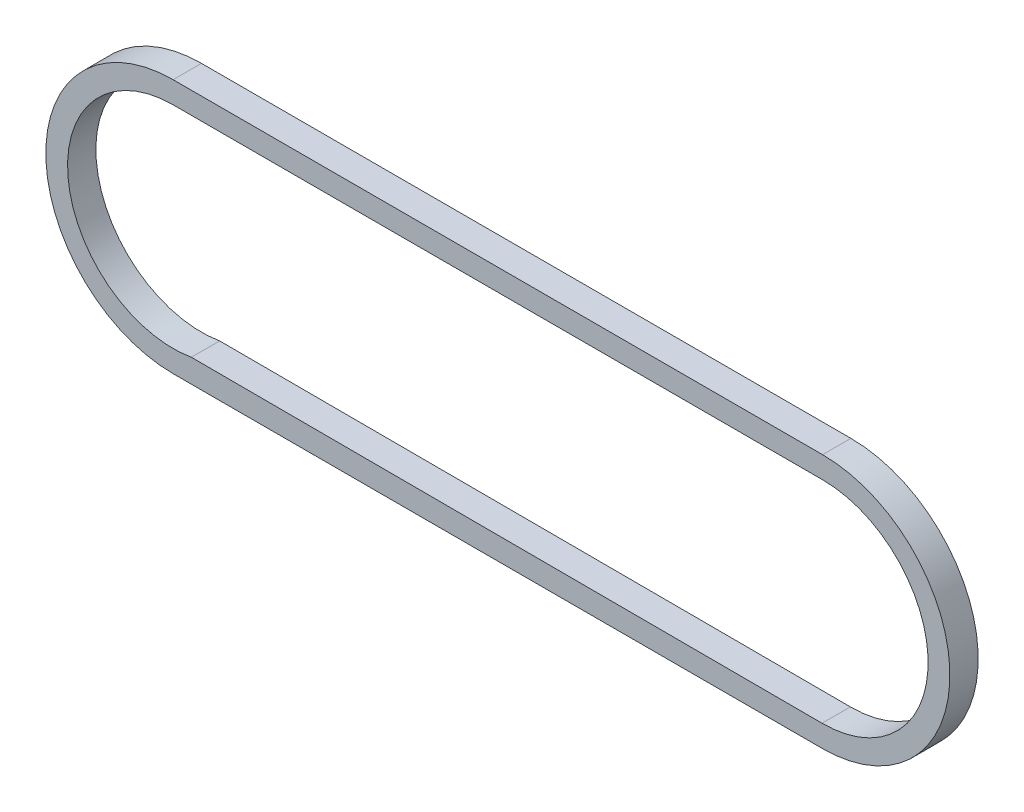
ISO-10303-21;
HEADER;
FILE_DESCRIPTION(('STEP AP214'),'2;1');
FILE_NAME('part.step','',(''),(''),'','','');
FILE_SCHEMA(('AUTOMOTIVE_DESIGN { 1 0 10303 214 1 1 1 1 }'));
ENDSEC;
DATA;
#1=APPLICATION_CONTEXT('core data for automotive mechanical design processes');
#2=APPLICATION_PROTOCOL_DEFINITION('international standard','automotive_design',2000,#1);
#3=PRODUCT_CONTEXT('',#1,'mechanical');
#4=PRODUCT('Part','Part','',(#3));
#5=PRODUCT_RELATED_PRODUCT_CATEGORY('part','',(#4));
#6=PRODUCT_DEFINITION_FORMATION('','',#4);
#7=PRODUCT_DEFINITION_CONTEXT('part definition',#1,'design');
#8=PRODUCT_DEFINITION('design','',#6,#7);
#9=PRODUCT_DEFINITION_SHAPE('','',#8);
#10=(LENGTH_UNIT() NAMED_UNIT(*) SI_UNIT(.MILLI.,.METRE.));
#11=(NAMED_UNIT(*) PLANE_ANGLE_UNIT() SI_UNIT($,.RADIAN.));
#12=(NAMED_UNIT(*) SI_UNIT($,.STERADIAN.) SOLID_ANGLE_UNIT());
#13=UNCERTAINTY_MEASURE_WITH_UNIT(LENGTH_MEASURE(1.E-05),#10,'distance_accuracy_value','');
#14=(GEOMETRIC_REPRESENTATION_CONTEXT(3) GLOBAL_UNCERTAINTY_ASSIGNED_CONTEXT((#13)) GLOBAL_UNIT_ASSIGNED_CONTEXT((#10,
#11,#12)) REPRESENTATION_CONTEXT('',''));
#15=CARTESIAN_POINT('',(0.,0.,0.));
#16=DIRECTION('',(0.,0.,1.));
#17=DIRECTION('',(1.,0.,0.));
#18=AXIS2_PLACEMENT_3D('',#15,#16,#17);
#19=CARTESIAN_POINT('',(0.,49.,-9.9));
#20=DIRECTION('',(0.,-1.,0.));
#21=DIRECTION('',(1.,0.,0.));
#22=AXIS2_PLACEMENT_3D('',#19,#20,#21);
#23=PLANE('',#22);
#24=DIRECTION('',(0.,0.,1.));
#25=VECTOR('',#24,1.);
#26=CARTESIAN_POINT('',(-250.,49.,-9.9));
#27=LINE('',#26,#25);
#28=CARTESIAN_POINT('',(-250.,49.,-9.9));
#29=VERTEX_POINT('',#28);
#30=CARTESIAN_POINT('',(-250.,49.,1.));
#31=VERTEX_POINT('',#30);
#32=EDGE_CURVE('E160',#29,#31,#27,.T.);
#33=ORIENTED_EDGE('',*,*,#32,.T.);
#34=DIRECTION('',(1.,0.,0.));
#35=VECTOR('',#34,1.);
#36=CARTESIAN_POINT('',(0.,49.,1.));
#37=LINE('',#36,#35);
#38=CARTESIAN_POINT('',(0.,49.,1.));
#39=VERTEX_POINT('',#38);
#40=EDGE_CURVE('E130',#31,#39,#37,.T.);
#41=ORIENTED_EDGE('',*,*,#40,.T.);
#42=DIRECTION('',(0.,0.,1.));
#43=VECTOR('',#42,1.);
#44=CARTESIAN_POINT('',(0.,49.,-9.9));
#45=LINE('',#44,#43);
#46=CARTESIAN_POINT('',(0.,49.,-9.9));
#47=VERTEX_POINT('',#46);
#48=EDGE_CURVE('E11',#47,#39,#45,.T.);
#49=ORIENTED_EDGE('',*,*,#48,.F.);
#50=DIRECTION('',(1.,0.,0.));
#51=VECTOR('',#50,1.);
#52=CARTESIAN_POINT('',(0.,49.,-9.9));
#53=LINE('',#52,#51);
#54=EDGE_CURVE('E51',#29,#47,#53,.T.);
#55=ORIENTED_EDGE('',*,*,#54,.F.);
#56=EDGE_LOOP('',(#33,#41,#49,#55));
#57=FACE_BOUND('',#56,.T.);
#58=ADVANCED_FACE('F34',(#57),#23,.F.);
#59=CARTESIAN_POINT('',(0.,0.,-9.9));
#60=DIRECTION('',(0.,0.,1.));
#61=DIRECTION('',(1.,0.,0.));
#62=AXIS2_PLACEMENT_3D('',#59,#60,#61);
#63=CYLINDRICAL_SURFACE('',#62,49.);
#64=ORIENTED_EDGE('',*,*,#48,.T.);
#65=CARTESIAN_POINT('',(0.,0.,1.));
#66=DIRECTION('',(0.,0.,1.));
#67=DIRECTION('',(1.,0.,0.));
#68=AXIS2_PLACEMENT_3D('',#65,#66,#67);
#69=CIRCLE('',#68,49.);
#70=CARTESIAN_POINT('',(0.,-49.,1.));
#71=VERTEX_POINT('',#70);
#72=EDGE_CURVE('E139',#71,#39,#69,.T.);
#73=ORIENTED_EDGE('',*,*,#72,.F.);
#74=DIRECTION('',(0.,0.,1.));
#75=VECTOR('',#74,1.);
#76=CARTESIAN_POINT('',(0.,-49.,-9.9));
#77=LINE('',#76,#75);
#78=CARTESIAN_POINT('',(0.,-49.,-9.9));
#79=VERTEX_POINT('',#78);
#80=EDGE_CURVE('E43',#79,#71,#77,.T.);
#81=ORIENTED_EDGE('',*,*,#80,.F.);
#82=CARTESIAN_POINT('',(0.,0.,-9.9));
#83=DIRECTION('',(0.,0.,1.));
#84=DIRECTION('',(1.,0.,0.));
#85=AXIS2_PLACEMENT_3D('',#82,#83,#84);
#86=CIRCLE('',#85,49.);
#87=EDGE_CURVE('E111',#79,#47,#86,.T.);
#88=ORIENTED_EDGE('',*,*,#87,.T.);
#89=EDGE_LOOP('',(#64,#73,#81,#88));
#90=FACE_BOUND('',#89,.T.);
#91=ADVANCED_FACE('F185',(#90),#63,.T.);
#92=CARTESIAN_POINT('',(0.,-49.,-9.9));
#93=DIRECTION('',(0.,1.,0.));
#94=DIRECTION('',(-1.,0.,0.));
#95=AXIS2_PLACEMENT_3D('',#92,#93,#94);
#96=PLANE('',#95);
#97=ORIENTED_EDGE('',*,*,#80,.T.);
#98=DIRECTION('',(-1.,0.,0.));
#99=VECTOR('',#98,1.);
#100=CARTESIAN_POINT('',(0.,-49.,1.));
#101=LINE('',#100,#99);
#102=CARTESIAN_POINT('',(-250.,-49.0000000000001,1.));
#103=VERTEX_POINT('',#102);
#104=EDGE_CURVE('E136',#71,#103,#101,.T.);
#105=ORIENTED_EDGE('',*,*,#104,.T.);
#106=DIRECTION('',(0.,0.,1.));
#107=VECTOR('',#106,1.);
#108=CARTESIAN_POINT('',(-250.,-49.0000000000001,-9.9));
#109=LINE('',#108,#107);
#110=CARTESIAN_POINT('',(-250.,-49.0000000000001,-9.9));
#111=VERTEX_POINT('',#110);
#112=EDGE_CURVE('E158',#111,#103,#109,.T.);
#113=ORIENTED_EDGE('',*,*,#112,.F.);
#114=DIRECTION('',(-1.,0.,0.));
#115=VECTOR('',#114,1.);
#116=CARTESIAN_POINT('',(0.,-49.,-9.9));
#117=LINE('',#116,#115);
#118=EDGE_CURVE('E154',#79,#111,#117,.T.);
#119=ORIENTED_EDGE('',*,*,#118,.F.);
#120=EDGE_LOOP('',(#97,#105,#113,#119));
#121=FACE_BOUND('',#120,.T.);
#122=ADVANCED_FACE('F191',(#121),#96,.F.);
#123=CARTESIAN_POINT('',(-250.,0.,-9.9));
#124=DIRECTION('',(0.,0.,1.));
#125=DIRECTION('',(1.,0.,0.));
#126=AXIS2_PLACEMENT_3D('',#123,#124,#125);
#127=CYLINDRICAL_SURFACE('',#126,40.63);
#128=DIRECTION('',(0.,0.,1.));
#129=VECTOR('',#128,1.);
#130=CARTESIAN_POINT('',(-250.,40.6299999999999,-9.9));
#131=LINE('',#130,#129);
#132=CARTESIAN_POINT('',(-250.,40.6299999999999,-9.9));
#133=VERTEX_POINT('',#132);
#134=CARTESIAN_POINT('',(-250.,40.6299999999999,1.));
#135=VERTEX_POINT('',#134);
#136=EDGE_CURVE('E38',#133,#135,#131,.T.);
#137=ORIENTED_EDGE('',*,*,#136,.T.);
#138=CARTESIAN_POINT('',(-250.,0.,1.));
#139=DIRECTION('',(0.,0.,1.));
#140=DIRECTION('',(1.,0.,0.));
#141=AXIS2_PLACEMENT_3D('',#138,#139,#140);
#142=CIRCLE('',#141,40.63);
#143=CARTESIAN_POINT('',(-242.97291482572,-40.0177082546392,1.));
#144=VERTEX_POINT('',#143);
#145=EDGE_CURVE('E105',#135,#144,#142,.T.);
#146=ORIENTED_EDGE('',*,*,#145,.T.);
#147=DIRECTION('',(0.,0.,1.));
#148=VECTOR('',#147,1.);
#149=CARTESIAN_POINT('',(-242.97291482572,-40.0177082546392,-9.9));
#150=LINE('',#149,#148);
#151=CARTESIAN_POINT('',(-242.97291482572,-40.0177082546392,-9.9));
#152=VERTEX_POINT('',#151);
#153=EDGE_CURVE('E162',#152,#144,#150,.T.);
#154=ORIENTED_EDGE('',*,*,#153,.F.);
#155=CARTESIAN_POINT('',(-250.,0.,-9.9));
#156=DIRECTION('',(0.,0.,1.));
#157=DIRECTION('',(1.,0.,0.));
#158=AXIS2_PLACEMENT_3D('',#155,#156,#157);
#159=CIRCLE('',#158,40.63);
#160=EDGE_CURVE('E106',#133,#152,#159,.T.);
#161=ORIENTED_EDGE('',*,*,#160,.F.);
#162=EDGE_LOOP('',(#137,#146,#154,#161));
#163=FACE_BOUND('',#162,.T.);
#164=ADVANCED_FACE('F36',(#163),#127,.F.);
#165=CARTESIAN_POINT('',(-0.102386949801904,-40.6297419848865,-9.9));
#166=DIRECTION('',(0.00251999199853385,0.999996824815123,0.));
#167=DIRECTION('',(-0.999996824815123,0.00251999199853385,0.));
#168=AXIS2_PLACEMENT_3D('',#165,#166,#167);
#169=PLANE('',#168);
#170=ORIENTED_EDGE('',*,*,#153,.T.);
#171=DIRECTION('',(-0.999996824815123,0.00251999199853385,0.));
#172=VECTOR('',#171,1.);
#173=CARTESIAN_POINT('',(-0.102386949801904,-40.6297419848865,1.));
#174=LINE('',#173,#172);
#175=CARTESIAN_POINT('',(-0.204773899601046,-40.629483969773,1.));
#176=VERTEX_POINT('',#175);
#177=EDGE_CURVE('E125',#176,#144,#174,.T.);
#178=ORIENTED_EDGE('',*,*,#177,.F.);
#179=DIRECTION('',(0.,0.,1.));
#180=VECTOR('',#179,1.);
#181=CARTESIAN_POINT('',(-0.204773899601046,-40.629483969773,-9.9));
#182=LINE('',#181,#180);
#183=CARTESIAN_POINT('',(-0.204773899601046,-40.629483969773,-9.9));
#184=VERTEX_POINT('',#183);
#185=EDGE_CURVE('E164',#184,#176,#182,.T.);
#186=ORIENTED_EDGE('',*,*,#185,.F.);
#187=DIRECTION('',(-0.999996824815123,0.00251999199853385,0.));
#188=VECTOR('',#187,1.);
#189=CARTESIAN_POINT('',(-0.102386949801904,-40.6297419848865,-9.9));
#190=LINE('',#189,#188);
#191=EDGE_CURVE('E147',#184,#152,#190,.T.);
#192=ORIENTED_EDGE('',*,*,#191,.T.);
#193=EDGE_LOOP('',(#170,#178,#186,#192));
#194=FACE_BOUND('',#193,.T.);
#195=ADVANCED_FACE('F170',(#194),#169,.T.);
#196=CARTESIAN_POINT('',(0.,0.,-9.9));
#197=DIRECTION('',(0.,0.,1.));
#198=DIRECTION('',(1.,0.,0.));
#199=AXIS2_PLACEMENT_3D('',#196,#197,#198);
#200=CYLINDRICAL_SURFACE('',#199,40.63);
#201=ORIENTED_EDGE('',*,*,#185,.T.);
#202=CARTESIAN_POINT('',(0.,0.,1.));
#203=DIRECTION('',(0.,0.,1.));
#204=DIRECTION('',(1.,0.,0.));
#205=AXIS2_PLACEMENT_3D('',#202,#203,#204);
#206=CIRCLE('',#205,40.63);
#207=CARTESIAN_POINT('',(0.,40.63,1.));
#208=VERTEX_POINT('',#207);
#209=EDGE_CURVE('E119',#176,#208,#206,.T.);
#210=ORIENTED_EDGE('',*,*,#209,.T.);
#211=DIRECTION('',(0.,0.,1.));
#212=VECTOR('',#211,1.);
#213=CARTESIAN_POINT('',(0.,40.63,-9.9));
#214=LINE('',#213,#212);
#215=CARTESIAN_POINT('',(0.,40.63,-9.9));
#216=VERTEX_POINT('',#215);
#217=EDGE_CURVE('E110',#216,#208,#214,.T.);
#218=ORIENTED_EDGE('',*,*,#217,.F.);
#219=CARTESIAN_POINT('',(0.,0.,-9.9));
#220=DIRECTION('',(0.,0.,1.));
#221=DIRECTION('',(1.,0.,0.));
#222=AXIS2_PLACEMENT_3D('',#219,#220,#221);
#223=CIRCLE('',#222,40.63);
#224=EDGE_CURVE('E145',#184,#216,#223,.T.);
#225=ORIENTED_EDGE('',*,*,#224,.F.);
#226=EDGE_LOOP('',(#201,#210,#218,#225));
#227=FACE_BOUND('',#226,.T.);
#228=ADVANCED_FACE('F167',(#227),#200,.F.);
#229=CARTESIAN_POINT('',(0.,40.63,-9.9));
#230=DIRECTION('',(0.,-1.,0.));
#231=DIRECTION('',(1.,0.,0.));
#232=AXIS2_PLACEMENT_3D('',#229,#230,#231);
#233=PLANE('',#232);
#234=ORIENTED_EDGE('',*,*,#217,.T.);
#235=DIRECTION('',(1.,0.,0.));
#236=VECTOR('',#235,1.);
#237=CARTESIAN_POINT('',(0.,40.63,1.));
#238=LINE('',#237,#236);
#239=EDGE_CURVE('E113',#135,#208,#238,.T.);
#240=ORIENTED_EDGE('',*,*,#239,.F.);
#241=ORIENTED_EDGE('',*,*,#136,.F.);
#242=DIRECTION('',(1.,0.,0.));
#243=VECTOR('',#242,1.);
#244=CARTESIAN_POINT('',(0.,40.63,-9.9));
#245=LINE('',#244,#243);
#246=EDGE_CURVE('E143',#133,#216,#245,.T.);
#247=ORIENTED_EDGE('',*,*,#246,.T.);
#248=EDGE_LOOP('',(#234,#240,#241,#247));
#249=FACE_BOUND('',#248,.T.);
#250=ADVANCED_FACE('F114',(#249),#233,.T.);
#251=CARTESIAN_POINT('',(-250.,0.,-9.9));
#252=DIRECTION('',(0.,0.,1.));
#253=DIRECTION('',(1.,0.,0.));
#254=AXIS2_PLACEMENT_3D('',#251,#252,#253);
#255=CYLINDRICAL_SURFACE('',#254,49.);
#256=ORIENTED_EDGE('',*,*,#112,.T.);
#257=CARTESIAN_POINT('',(-250.,0.,1.));
#258=DIRECTION('',(0.,0.,1.));
#259=DIRECTION('',(1.,0.,0.));
#260=AXIS2_PLACEMENT_3D('',#257,#258,#259);
#261=CIRCLE('',#260,49.);
#262=EDGE_CURVE('E133',#31,#103,#261,.T.);
#263=ORIENTED_EDGE('',*,*,#262,.F.);
#264=ORIENTED_EDGE('',*,*,#32,.F.);
#265=CARTESIAN_POINT('',(-250.,0.,-9.9));
#266=DIRECTION('',(0.,0.,1.));
#267=DIRECTION('',(1.,0.,0.));
#268=AXIS2_PLACEMENT_3D('',#265,#266,#267);
#269=CIRCLE('',#268,49.);
#270=EDGE_CURVE('E151',#29,#111,#269,.T.);
#271=ORIENTED_EDGE('',*,*,#270,.T.);
#272=EDGE_LOOP('',(#256,#263,#264,#271));
#273=FACE_BOUND('',#272,.T.);
#274=ADVANCED_FACE('F174',(#273),#255,.T.);
#275=CARTESIAN_POINT('',(0.,0.,-9.9));
#276=DIRECTION('',(0.,0.,1.));
#277=DIRECTION('',(1.,0.,0.));
#278=AXIS2_PLACEMENT_3D('',#275,#276,#277);
#279=PLANE('',#278);
#280=ORIENTED_EDGE('',*,*,#160,.T.);
#281=ORIENTED_EDGE('',*,*,#191,.F.);
#282=ORIENTED_EDGE('',*,*,#224,.T.);
#283=ORIENTED_EDGE('',*,*,#246,.F.);
#284=EDGE_LOOP('',(#280,#281,#282,#283));
#285=FACE_BOUND('',#284,.T.);
#286=ORIENTED_EDGE('',*,*,#54,.T.);
#287=ORIENTED_EDGE('',*,*,#87,.F.);
#288=ORIENTED_EDGE('',*,*,#118,.T.);
#289=ORIENTED_EDGE('',*,*,#270,.F.);
#290=EDGE_LOOP('',(#286,#287,#288,#289));
#291=FACE_BOUND('',#290,.T.);
#292=ADVANCED_FACE('F172',(#285,#291),#279,.F.);
#293=CARTESIAN_POINT('',(0.,0.,1.));
#294=DIRECTION('',(0.,0.,1.));
#295=DIRECTION('',(1.,0.,0.));
#296=AXIS2_PLACEMENT_3D('',#293,#294,#295);
#297=PLANE('',#296);
#298=ORIENTED_EDGE('',*,*,#145,.F.);
#299=ORIENTED_EDGE('',*,*,#239,.T.);
#300=ORIENTED_EDGE('',*,*,#209,.F.);
#301=ORIENTED_EDGE('',*,*,#177,.T.);
#302=EDGE_LOOP('',(#298,#299,#300,#301));
#303=FACE_BOUND('',#302,.T.);
#304=ORIENTED_EDGE('',*,*,#40,.F.);
#305=ORIENTED_EDGE('',*,*,#262,.T.);
#306=ORIENTED_EDGE('',*,*,#104,.F.);
#307=ORIENTED_EDGE('',*,*,#72,.T.);
#308=EDGE_LOOP('',(#304,#305,#306,#307));
#309=FACE_BOUND('',#308,.T.);
#310=ADVANCED_FACE('F122',(#303,#309),#297,.T.);
#311=CLOSED_SHELL('',(#58,#91,#122,#164,#195,#228,#250,#274,#292,#310));
#312=MANIFOLD_SOLID_BREP('B2',#311);
#313=ADVANCED_BREP_SHAPE_REPRESENTATION('',(#18,#312),#14);
#314=SHAPE_DEFINITION_REPRESENTATION(#9,#313);
ENDSEC;
END-ISO-10303-21;
